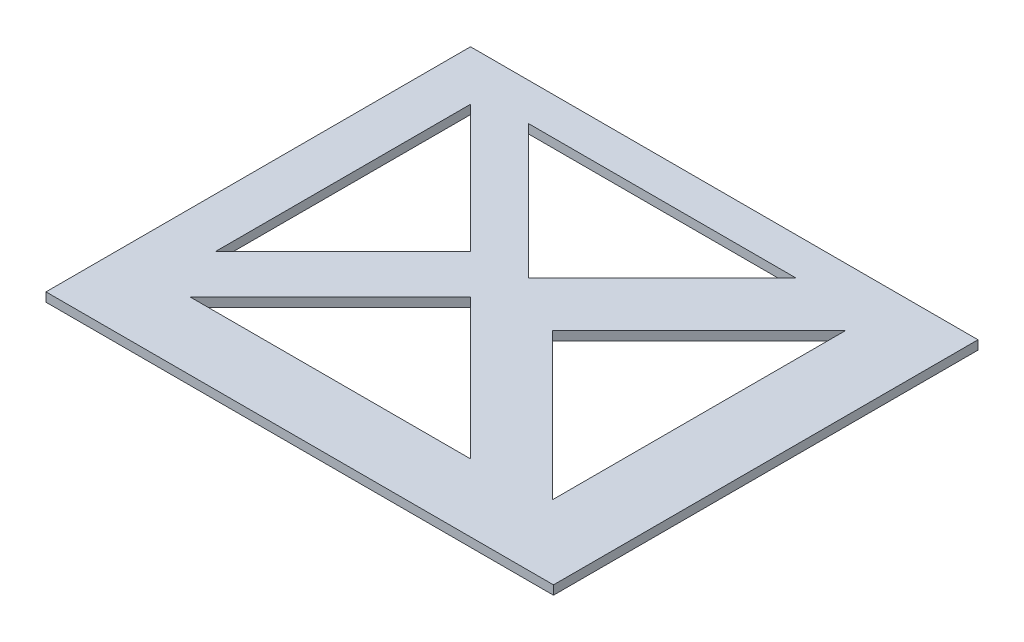
ISO-10303-21;
HEADER;
FILE_DESCRIPTION(('STEP AP214'),'2;1');
FILE_NAME('part.step','',(''),(''),'','','');
FILE_SCHEMA(('AUTOMOTIVE_DESIGN { 1 0 10303 214 1 1 1 1 }'));
ENDSEC;
DATA;
#1=APPLICATION_CONTEXT('core data for automotive mechanical design processes');
#2=APPLICATION_PROTOCOL_DEFINITION('international standard','automotive_design',2000,#1);
#3=PRODUCT_CONTEXT('',#1,'mechanical');
#4=PRODUCT('Part','Part','',(#3));
#5=PRODUCT_RELATED_PRODUCT_CATEGORY('part','',(#4));
#6=PRODUCT_DEFINITION_FORMATION('','',#4);
#7=PRODUCT_DEFINITION_CONTEXT('part definition',#1,'design');
#8=PRODUCT_DEFINITION('design','',#6,#7);
#9=PRODUCT_DEFINITION_SHAPE('','',#8);
#10=(LENGTH_UNIT() NAMED_UNIT(*) SI_UNIT(.MILLI.,.METRE.));
#11=(NAMED_UNIT(*) PLANE_ANGLE_UNIT() SI_UNIT($,.RADIAN.));
#12=(NAMED_UNIT(*) SI_UNIT($,.STERADIAN.) SOLID_ANGLE_UNIT());
#13=UNCERTAINTY_MEASURE_WITH_UNIT(LENGTH_MEASURE(1.E-05),#10,'distance_accuracy_value','');
#14=(GEOMETRIC_REPRESENTATION_CONTEXT(3) GLOBAL_UNCERTAINTY_ASSIGNED_CONTEXT((#13)) GLOBAL_UNIT_ASSIGNED_CONTEXT((#10,
#11,#12)) REPRESENTATION_CONTEXT('',''));
#15=CARTESIAN_POINT('',(0.,0.,0.));
#16=DIRECTION('',(0.,0.,1.));
#17=DIRECTION('',(1.,0.,0.));
#18=AXIS2_PLACEMENT_3D('',#15,#16,#17);
#19=CARTESIAN_POINT('',(0.,0.,0.));
#20=DIRECTION('',(0.,1.,0.));
#21=DIRECTION('',(0.,0.,1.));
#22=AXIS2_PLACEMENT_3D('',#19,#20,#21);
#23=PLANE('',#22);
#24=DIRECTION('',(-0.707106781186547,0.,-0.707106781186548));
#25=VECTOR('',#24,1.);
#26=CARTESIAN_POINT('',(-90.4001985049659,0.,-128.91776936157));
#27=LINE('',#26,#25);
#28=CARTESIAN_POINT('',(-90.4001985049659,0.,-128.91776936157));
#29=VERTEX_POINT('',#28);
#30=CARTESIAN_POINT('',(-105.95654769107,0.,-144.474118547674));
#31=VERTEX_POINT('',#30);
#32=EDGE_CURVE('E193',#29,#31,#27,.T.);
#33=ORIENTED_EDGE('',*,*,#32,.T.);
#34=DIRECTION('',(-0.707106781186547,0.,0.707106781186548));
#35=VECTOR('',#34,1.);
#36=CARTESIAN_POINT('',(-105.95654769107,0.,-144.474118547674));
#37=LINE('',#36,#35);
#38=CARTESIAN_POINT('',(-121.512896877174,0.,-128.91776936157));
#39=VERTEX_POINT('',#38);
#40=EDGE_CURVE('E196',#31,#39,#37,.T.);
#41=ORIENTED_EDGE('',*,*,#40,.T.);
#42=DIRECTION('',(1.,0.,0.));
#43=VECTOR('',#42,1.);
#44=CARTESIAN_POINT('',(-121.512896877174,0.,-128.91776936157));
#45=LINE('',#44,#43);
#46=EDGE_CURVE('E199',#39,#29,#45,.T.);
#47=ORIENTED_EDGE('',*,*,#46,.T.);
#48=EDGE_LOOP('',(#33,#41,#47));
#49=FACE_BOUND('',#48,.T.);
#50=DIRECTION('',(-0.707106781186547,0.,-0.707106781186547));
#51=VECTOR('',#50,1.);
#52=CARTESIAN_POINT('',(-110.367742536169,0.,-148.885313392773));
#53=LINE('',#52,#51);
#54=CARTESIAN_POINT('',(-110.367742536169,0.,-148.885313392773));
#55=VERTEX_POINT('',#54);
#56=CARTESIAN_POINT('',(-124.5098781599,0.,-163.027449016504));
#57=VERTEX_POINT('',#56);
#58=EDGE_CURVE('E223',#55,#57,#53,.T.);
#59=ORIENTED_EDGE('',*,*,#58,.T.);
#60=DIRECTION('',(0.,0.,1.));
#61=VECTOR('',#60,1.);
#62=CARTESIAN_POINT('',(-124.5098781599,0.,-163.027449016504));
#63=LINE('',#62,#61);
#64=CARTESIAN_POINT('',(-124.5098781599,0.,-134.743177769042));
#65=VERTEX_POINT('',#64);
#66=EDGE_CURVE('E226',#57,#65,#63,.T.);
#67=ORIENTED_EDGE('',*,*,#66,.T.);
#68=DIRECTION('',(0.707106781186547,0.,-0.707106781186548));
#69=VECTOR('',#68,1.);
#70=CARTESIAN_POINT('',(-124.5098781599,0.,-134.743177769042));
#71=LINE('',#70,#69);
#72=EDGE_CURVE('E229',#65,#55,#71,.T.);
#73=ORIENTED_EDGE('',*,*,#72,.T.);
#74=EDGE_LOOP('',(#59,#67,#73));
#75=FACE_BOUND('',#74,.T.);
#76=DIRECTION('',(0.,0.,1.));
#77=VECTOR('',#76,1.);
#78=CARTESIAN_POINT('',(-73.6750586068764,0.,-121.406962028885));
#79=LINE('',#78,#77);
#80=CARTESIAN_POINT('',(-73.6750586068764,0.,-168.557732279811));
#81=VERTEX_POINT('',#80);
#82=CARTESIAN_POINT('',(-73.6750586068764,0.,-121.406962028885));
#83=VERTEX_POINT('',#82);
#84=EDGE_CURVE('E246',#81,#83,#79,.T.);
#85=ORIENTED_EDGE('',*,*,#84,.T.);
#86=DIRECTION('',(-1.,0.,0.));
#87=VECTOR('',#86,1.);
#88=CARTESIAN_POINT('',(-130.040161423208,0.,-121.406962028885));
#89=LINE('',#88,#87);
#90=CARTESIAN_POINT('',(-130.040161423208,0.,-121.406962028885));
#91=VERTEX_POINT('',#90);
#92=EDGE_CURVE('E177',#83,#91,#89,.T.);
#93=ORIENTED_EDGE('',*,*,#92,.T.);
#94=DIRECTION('',(0.,0.,1.));
#95=VECTOR('',#94,1.);
#96=CARTESIAN_POINT('',(-130.040161423208,0.,-168.557732279811));
#97=LINE('',#96,#95);
#98=CARTESIAN_POINT('',(-130.040161423208,0.,-168.557732279811));
#99=VERTEX_POINT('',#98);
#100=EDGE_CURVE('E43',#99,#91,#97,.T.);
#101=ORIENTED_EDGE('',*,*,#100,.F.);
#102=DIRECTION('',(-1.,0.,0.));
#103=VECTOR('',#102,1.);
#104=CARTESIAN_POINT('',(-130.040161423208,0.,-168.557732279811));
#105=LINE('',#104,#103);
#106=EDGE_CURVE('E238',#81,#99,#105,.T.);
#107=ORIENTED_EDGE('',*,*,#106,.F.);
#108=EDGE_LOOP('',(#85,#93,#101,#107));
#109=FACE_BOUND('',#108,.T.);
#110=DIRECTION('',(-1.,0.,0.));
#111=VECTOR('',#110,1.);
#112=CARTESIAN_POINT('',(-89.7550085878665,0.,-164.389725441387));
#113=LINE('',#112,#111);
#114=CARTESIAN_POINT('',(-89.7550085878665,0.,-164.389725441387));
#115=VERTEX_POINT('',#114);
#116=CARTESIAN_POINT('',(-119.453493397702,0.,-164.389725441387));
#117=VERTEX_POINT('',#116);
#118=EDGE_CURVE('E208',#115,#117,#113,.T.);
#119=ORIENTED_EDGE('',*,*,#118,.T.);
#120=DIRECTION('',(0.707106781186548,0.,0.707106781186548));
#121=VECTOR('',#120,1.);
#122=CARTESIAN_POINT('',(-119.453493397702,0.,-164.389725441387));
#123=LINE('',#122,#121);
#124=CARTESIAN_POINT('',(-104.604250992784,0.,-149.54048303647));
#125=VERTEX_POINT('',#124);
#126=EDGE_CURVE('E211',#117,#125,#123,.T.);
#127=ORIENTED_EDGE('',*,*,#126,.T.);
#128=DIRECTION('',(0.707106781186547,0.,-0.707106781186547));
#129=VECTOR('',#128,1.);
#130=CARTESIAN_POINT('',(-104.604250992784,0.,-149.54048303647));
#131=LINE('',#130,#129);
#132=EDGE_CURVE('E214',#125,#115,#131,.T.);
#133=ORIENTED_EDGE('',*,*,#132,.T.);
#134=EDGE_LOOP('',(#119,#127,#133));
#135=FACE_BOUND('',#134,.T.);
#136=DIRECTION('',(0.,0.,-1.));
#137=VECTOR('',#136,1.);
#138=CARTESIAN_POINT('',(-81.9149171307273,0.,-162.053694750293));
#139=LINE('',#138,#137);
#140=CARTESIAN_POINT('',(-81.9149171307273,0.,-129.526782815712));
#141=VERTEX_POINT('',#140);
#142=CARTESIAN_POINT('',(-81.9149171307273,0.,-162.053694750293));
#143=VERTEX_POINT('',#142);
#144=EDGE_CURVE('E169',#141,#143,#139,.T.);
#145=ORIENTED_EDGE('',*,*,#144,.T.);
#146=DIRECTION('',(-0.707106781186548,0.,0.707106781186548));
#147=VECTOR('',#146,1.);
#148=CARTESIAN_POINT('',(-81.9149171307273,0.,-162.053694750293));
#149=LINE('',#148,#147);
#150=CARTESIAN_POINT('',(-98.1783730980179,0.,-145.790238783002));
#151=VERTEX_POINT('',#150);
#152=EDGE_CURVE('E172',#143,#151,#149,.T.);
#153=ORIENTED_EDGE('',*,*,#152,.T.);
#154=DIRECTION('',(0.707106781186548,0.,0.707106781186548));
#155=VECTOR('',#154,1.);
#156=CARTESIAN_POINT('',(-98.1783730980179,0.,-145.790238783002));
#157=LINE('',#156,#155);
#158=EDGE_CURVE('E184',#151,#141,#157,.T.);
#159=ORIENTED_EDGE('',*,*,#158,.T.);
#160=EDGE_LOOP('',(#145,#153,#159));
#161=FACE_BOUND('',#160,.T.);
#162=ADVANCED_FACE('F35',(#49,#75,#109,#135,#161),#23,.F.);
#163=CARTESIAN_POINT('',(-130.040161423208,10.,-168.557732279811));
#164=DIRECTION('',(0.,0.,1.));
#165=DIRECTION('',(1.,0.,0.));
#166=AXIS2_PLACEMENT_3D('',#163,#164,#165);
#167=PLANE('',#166);
#168=DIRECTION('',(0.,-1.,0.));
#169=VECTOR('',#168,1.);
#170=CARTESIAN_POINT('',(-130.040161423208,10.,-168.557732279811));
#171=LINE('',#170,#169);
#172=CARTESIAN_POINT('',(-130.040161423208,1.,-168.557732279811));
#173=VERTEX_POINT('',#172);
#174=EDGE_CURVE('E11',#173,#99,#171,.T.);
#175=ORIENTED_EDGE('',*,*,#174,.F.);
#176=DIRECTION('',(-1.,0.,0.));
#177=VECTOR('',#176,1.);
#178=CARTESIAN_POINT('',(-130.040161423208,1.,-168.557732279811));
#179=LINE('',#178,#177);
#180=CARTESIAN_POINT('',(-73.6750586068764,1.,-168.557732279811));
#181=VERTEX_POINT('',#180);
#182=EDGE_CURVE('E152',#181,#173,#179,.T.);
#183=ORIENTED_EDGE('',*,*,#182,.F.);
#184=DIRECTION('',(0.,1.,0.));
#185=VECTOR('',#184,1.);
#186=CARTESIAN_POINT('',(-73.6750586068764,0.,-168.557732279811));
#187=LINE('',#186,#185);
#188=EDGE_CURVE('E174',#81,#181,#187,.T.);
#189=ORIENTED_EDGE('',*,*,#188,.F.);
#190=ORIENTED_EDGE('',*,*,#106,.T.);
#191=EDGE_LOOP('',(#175,#183,#189,#190));
#192=FACE_BOUND('',#191,.T.);
#193=ADVANCED_FACE('F37',(#192),#167,.F.);
#194=CARTESIAN_POINT('',(-130.040161423208,10.,-168.557732279811));
#195=DIRECTION('',(1.,0.,0.));
#196=DIRECTION('',(0.,0.,-1.));
#197=AXIS2_PLACEMENT_3D('',#194,#195,#196);
#198=PLANE('',#197);
#199=DIRECTION('',(0.,1.,0.));
#200=VECTOR('',#199,1.);
#201=CARTESIAN_POINT('',(-130.040161423208,0.,-121.406962028885));
#202=LINE('',#201,#200);
#203=CARTESIAN_POINT('',(-130.040161423208,1.,-121.406962028885));
#204=VERTEX_POINT('',#203);
#205=EDGE_CURVE('E161',#91,#204,#202,.T.);
#206=ORIENTED_EDGE('',*,*,#205,.T.);
#207=DIRECTION('',(0.,0.,1.));
#208=VECTOR('',#207,1.);
#209=CARTESIAN_POINT('',(-130.040161423208,1.,-121.406962028885));
#210=LINE('',#209,#208);
#211=EDGE_CURVE('E146',#173,#204,#210,.T.);
#212=ORIENTED_EDGE('',*,*,#211,.F.);
#213=ORIENTED_EDGE('',*,*,#174,.T.);
#214=ORIENTED_EDGE('',*,*,#100,.T.);
#215=EDGE_LOOP('',(#206,#212,#213,#214));
#216=FACE_BOUND('',#215,.T.);
#217=ADVANCED_FACE('F167',(#216),#198,.F.);
#218=CARTESIAN_POINT('',(-110.367742536169,10.,-148.885313392773));
#219=DIRECTION('',(-0.707106781186548,0.,0.707106781186548));
#220=DIRECTION('',(0.707106781186548,0.,0.707106781186548));
#221=AXIS2_PLACEMENT_3D('',#218,#219,#220);
#222=PLANE('',#221);
#223=DIRECTION('',(0.707106781186548,0.,0.707106781186548));
#224=VECTOR('',#223,1.);
#225=CARTESIAN_POINT('',(-110.367742536169,1.,-148.885313392773));
#226=LINE('',#225,#224);
#227=CARTESIAN_POINT('',(-124.5098781599,1.,-163.027449016504));
#228=VERTEX_POINT('',#227);
#229=CARTESIAN_POINT('',(-110.367742536169,1.,-148.885313392773));
#230=VERTEX_POINT('',#229);
#231=EDGE_CURVE('E50',#228,#230,#226,.T.);
#232=ORIENTED_EDGE('',*,*,#231,.F.);
#233=DIRECTION('',(0.,-1.,0.));
#234=VECTOR('',#233,1.);
#235=CARTESIAN_POINT('',(-124.5098781599,10.,-163.027449016504));
#236=LINE('',#235,#234);
#237=EDGE_CURVE('E236',#228,#57,#236,.T.);
#238=ORIENTED_EDGE('',*,*,#237,.T.);
#239=ORIENTED_EDGE('',*,*,#58,.F.);
#240=DIRECTION('',(0.,-1.,0.));
#241=VECTOR('',#240,1.);
#242=CARTESIAN_POINT('',(-110.367742536169,10.,-148.885313392773));
#243=LINE('',#242,#241);
#244=EDGE_CURVE('E232',#230,#55,#243,.T.);
#245=ORIENTED_EDGE('',*,*,#244,.F.);
#246=EDGE_LOOP('',(#232,#238,#239,#245));
#247=FACE_BOUND('',#246,.T.);
#248=ADVANCED_FACE('F291',(#247),#222,.T.);
#249=CARTESIAN_POINT('',(-124.5098781599,10.,-163.027449016504));
#250=DIRECTION('',(1.,0.,0.));
#251=DIRECTION('',(0.,0.,-1.));
#252=AXIS2_PLACEMENT_3D('',#249,#250,#251);
#253=PLANE('',#252);
#254=DIRECTION('',(0.,0.,-1.));
#255=VECTOR('',#254,1.);
#256=CARTESIAN_POINT('',(-124.5098781599,1.,-163.027449016504));
#257=LINE('',#256,#255);
#258=CARTESIAN_POINT('',(-124.5098781599,1.,-134.743177769042));
#259=VERTEX_POINT('',#258);
#260=EDGE_CURVE('E247',#259,#228,#257,.T.);
#261=ORIENTED_EDGE('',*,*,#260,.F.);
#262=DIRECTION('',(0.,-1.,0.));
#263=VECTOR('',#262,1.);
#264=CARTESIAN_POINT('',(-124.5098781599,10.,-134.743177769042));
#265=LINE('',#264,#263);
#266=EDGE_CURVE('E234',#259,#65,#265,.T.);
#267=ORIENTED_EDGE('',*,*,#266,.T.);
#268=ORIENTED_EDGE('',*,*,#66,.F.);
#269=ORIENTED_EDGE('',*,*,#237,.F.);
#270=EDGE_LOOP('',(#261,#267,#268,#269));
#271=FACE_BOUND('',#270,.T.);
#272=ADVANCED_FACE('F297',(#271),#253,.T.);
#273=CARTESIAN_POINT('',(-124.5098781599,10.,-134.743177769042));
#274=DIRECTION('',(-0.707106781186548,0.,-0.707106781186547));
#275=DIRECTION('',(-0.707106781186547,0.,0.707106781186548));
#276=AXIS2_PLACEMENT_3D('',#273,#274,#275);
#277=PLANE('',#276);
#278=DIRECTION('',(-0.707106781186547,0.,0.707106781186548));
#279=VECTOR('',#278,1.);
#280=CARTESIAN_POINT('',(-124.5098781599,1.,-134.743177769042));
#281=LINE('',#280,#279);
#282=EDGE_CURVE('E251',#230,#259,#281,.T.);
#283=ORIENTED_EDGE('',*,*,#282,.F.);
#284=ORIENTED_EDGE('',*,*,#244,.T.);
#285=ORIENTED_EDGE('',*,*,#72,.F.);
#286=ORIENTED_EDGE('',*,*,#266,.F.);
#287=EDGE_LOOP('',(#283,#284,#285,#286));
#288=FACE_BOUND('',#287,.T.);
#289=ADVANCED_FACE('F302',(#288),#277,.T.);
#290=CARTESIAN_POINT('',(-89.7550085878665,10.,-164.389725441387));
#291=DIRECTION('',(0.,0.,1.));
#292=DIRECTION('',(1.,0.,0.));
#293=AXIS2_PLACEMENT_3D('',#290,#291,#292);
#294=PLANE('',#293);
#295=DIRECTION('',(1.,0.,0.));
#296=VECTOR('',#295,1.);
#297=CARTESIAN_POINT('',(-89.7550085878665,1.,-164.389725441387));
#298=LINE('',#297,#296);
#299=CARTESIAN_POINT('',(-119.453493397702,1.,-164.389725441387));
#300=VERTEX_POINT('',#299);
#301=CARTESIAN_POINT('',(-89.7550085878665,1.,-164.389725441387));
#302=VERTEX_POINT('',#301);
#303=EDGE_CURVE('E58',#300,#302,#298,.T.);
#304=ORIENTED_EDGE('',*,*,#303,.F.);
#305=DIRECTION('',(0.,-1.,0.));
#306=VECTOR('',#305,1.);
#307=CARTESIAN_POINT('',(-119.453493397702,10.,-164.389725441387));
#308=LINE('',#307,#306);
#309=EDGE_CURVE('E221',#300,#117,#308,.T.);
#310=ORIENTED_EDGE('',*,*,#309,.T.);
#311=ORIENTED_EDGE('',*,*,#118,.F.);
#312=DIRECTION('',(0.,-1.,0.));
#313=VECTOR('',#312,1.);
#314=CARTESIAN_POINT('',(-89.7550085878665,10.,-164.389725441387));
#315=LINE('',#314,#313);
#316=EDGE_CURVE('E217',#302,#115,#315,.T.);
#317=ORIENTED_EDGE('',*,*,#316,.F.);
#318=EDGE_LOOP('',(#304,#310,#311,#317));
#319=FACE_BOUND('',#318,.T.);
#320=ADVANCED_FACE('F358',(#319),#294,.T.);
#321=CARTESIAN_POINT('',(-119.453493397702,10.,-164.389725441387));
#322=DIRECTION('',(0.707106781186548,0.,-0.707106781186548));
#323=DIRECTION('',(-0.707106781186548,0.,-0.707106781186548));
#324=AXIS2_PLACEMENT_3D('',#321,#322,#323);
#325=PLANE('',#324);
#326=DIRECTION('',(-0.707106781186548,0.,-0.707106781186548));
#327=VECTOR('',#326,1.);
#328=CARTESIAN_POINT('',(-119.453493397702,1.,-164.389725441387));
#329=LINE('',#328,#327);
#330=CARTESIAN_POINT('',(-104.604250992784,1.,-149.54048303647));
#331=VERTEX_POINT('',#330);
#332=EDGE_CURVE('E254',#331,#300,#329,.T.);
#333=ORIENTED_EDGE('',*,*,#332,.F.);
#334=DIRECTION('',(0.,-1.,0.));
#335=VECTOR('',#334,1.);
#336=CARTESIAN_POINT('',(-104.604250992784,10.,-149.54048303647));
#337=LINE('',#336,#335);
#338=EDGE_CURVE('E219',#331,#125,#337,.T.);
#339=ORIENTED_EDGE('',*,*,#338,.T.);
#340=ORIENTED_EDGE('',*,*,#126,.F.);
#341=ORIENTED_EDGE('',*,*,#309,.F.);
#342=EDGE_LOOP('',(#333,#339,#340,#341));
#343=FACE_BOUND('',#342,.T.);
#344=ADVANCED_FACE('F354',(#343),#325,.T.);
#345=CARTESIAN_POINT('',(-104.604250992784,10.,-149.54048303647));
#346=DIRECTION('',(-0.707106781186548,0.,-0.707106781186548));
#347=DIRECTION('',(-0.707106781186548,0.,0.707106781186548));
#348=AXIS2_PLACEMENT_3D('',#345,#346,#347);
#349=PLANE('',#348);
#350=DIRECTION('',(-0.707106781186548,0.,0.707106781186548));
#351=VECTOR('',#350,1.);
#352=CARTESIAN_POINT('',(-104.604250992784,1.,-149.54048303647));
#353=LINE('',#352,#351);
#354=EDGE_CURVE('E256',#302,#331,#353,.T.);
#355=ORIENTED_EDGE('',*,*,#354,.F.);
#356=ORIENTED_EDGE('',*,*,#316,.T.);
#357=ORIENTED_EDGE('',*,*,#132,.F.);
#358=ORIENTED_EDGE('',*,*,#338,.F.);
#359=EDGE_LOOP('',(#355,#356,#357,#358));
#360=FACE_BOUND('',#359,.T.);
#361=ADVANCED_FACE('F350',(#360),#349,.T.);
#362=CARTESIAN_POINT('',(-90.4001985049659,10.,-128.91776936157));
#363=DIRECTION('',(-0.707106781186548,0.,0.707106781186547));
#364=DIRECTION('',(0.707106781186547,0.,0.707106781186548));
#365=AXIS2_PLACEMENT_3D('',#362,#363,#364);
#366=PLANE('',#365);
#367=DIRECTION('',(0.707106781186547,0.,0.707106781186548));
#368=VECTOR('',#367,1.);
#369=CARTESIAN_POINT('',(-90.4001985049659,1.,-128.91776936157));
#370=LINE('',#369,#368);
#371=CARTESIAN_POINT('',(-105.95654769107,1.,-144.474118547674));
#372=VERTEX_POINT('',#371);
#373=CARTESIAN_POINT('',(-90.4001985049659,1.,-128.91776936157));
#374=VERTEX_POINT('',#373);
#375=EDGE_CURVE('E258',#372,#374,#370,.T.);
#376=ORIENTED_EDGE('',*,*,#375,.F.);
#377=DIRECTION('',(0.,-1.,0.));
#378=VECTOR('',#377,1.);
#379=CARTESIAN_POINT('',(-105.95654769107,10.,-144.474118547674));
#380=LINE('',#379,#378);
#381=EDGE_CURVE('E206',#372,#31,#380,.T.);
#382=ORIENTED_EDGE('',*,*,#381,.T.);
#383=ORIENTED_EDGE('',*,*,#32,.F.);
#384=DIRECTION('',(0.,-1.,0.));
#385=VECTOR('',#384,1.);
#386=CARTESIAN_POINT('',(-90.4001985049659,10.,-128.91776936157));
#387=LINE('',#386,#385);
#388=EDGE_CURVE('E202',#374,#29,#387,.T.);
#389=ORIENTED_EDGE('',*,*,#388,.F.);
#390=EDGE_LOOP('',(#376,#382,#383,#389));
#391=FACE_BOUND('',#390,.T.);
#392=ADVANCED_FACE('F346',(#391),#366,.T.);
#393=CARTESIAN_POINT('',(-105.95654769107,10.,-144.474118547674));
#394=DIRECTION('',(0.707106781186548,0.,0.707106781186547));
#395=DIRECTION('',(0.707106781186547,0.,-0.707106781186548));
#396=AXIS2_PLACEMENT_3D('',#393,#394,#395);
#397=PLANE('',#396);
#398=DIRECTION('',(0.707106781186547,0.,-0.707106781186548));
#399=VECTOR('',#398,1.);
#400=CARTESIAN_POINT('',(-105.95654769107,1.,-144.474118547674));
#401=LINE('',#400,#399);
#402=CARTESIAN_POINT('',(-121.512896877174,1.,-128.91776936157));
#403=VERTEX_POINT('',#402);
#404=EDGE_CURVE('E260',#403,#372,#401,.T.);
#405=ORIENTED_EDGE('',*,*,#404,.F.);
#406=DIRECTION('',(0.,-1.,0.));
#407=VECTOR('',#406,1.);
#408=CARTESIAN_POINT('',(-121.512896877174,10.,-128.91776936157));
#409=LINE('',#408,#407);
#410=EDGE_CURVE('E204',#403,#39,#409,.T.);
#411=ORIENTED_EDGE('',*,*,#410,.T.);
#412=ORIENTED_EDGE('',*,*,#40,.F.);
#413=ORIENTED_EDGE('',*,*,#381,.F.);
#414=EDGE_LOOP('',(#405,#411,#412,#413));
#415=FACE_BOUND('',#414,.T.);
#416=ADVANCED_FACE('F342',(#415),#397,.T.);
#417=CARTESIAN_POINT('',(-121.512896877174,10.,-128.91776936157));
#418=DIRECTION('',(0.,0.,-1.));
#419=DIRECTION('',(-1.,0.,0.));
#420=AXIS2_PLACEMENT_3D('',#417,#418,#419);
#421=PLANE('',#420);
#422=DIRECTION('',(-1.,0.,0.));
#423=VECTOR('',#422,1.);
#424=CARTESIAN_POINT('',(-121.512896877174,1.,-128.91776936157));
#425=LINE('',#424,#423);
#426=EDGE_CURVE('E262',#374,#403,#425,.T.);
#427=ORIENTED_EDGE('',*,*,#426,.F.);
#428=ORIENTED_EDGE('',*,*,#388,.T.);
#429=ORIENTED_EDGE('',*,*,#46,.F.);
#430=ORIENTED_EDGE('',*,*,#410,.F.);
#431=EDGE_LOOP('',(#427,#428,#429,#430));
#432=FACE_BOUND('',#431,.T.);
#433=ADVANCED_FACE('F337',(#432),#421,.T.);
#434=CARTESIAN_POINT('',(-81.9149171307273,10.,-162.053694750293));
#435=DIRECTION('',(-1.,0.,0.));
#436=DIRECTION('',(0.,0.,1.));
#437=AXIS2_PLACEMENT_3D('',#434,#435,#436);
#438=PLANE('',#437);
#439=DIRECTION('',(0.,0.,1.));
#440=VECTOR('',#439,1.);
#441=CARTESIAN_POINT('',(-81.9149171307273,1.,-162.053694750293));
#442=LINE('',#441,#440);
#443=CARTESIAN_POINT('',(-81.9149171307273,1.,-162.053694750293));
#444=VERTEX_POINT('',#443);
#445=CARTESIAN_POINT('',(-81.9149171307273,1.,-129.526782815712));
#446=VERTEX_POINT('',#445);
#447=EDGE_CURVE('E264',#444,#446,#442,.T.);
#448=ORIENTED_EDGE('',*,*,#447,.F.);
#449=DIRECTION('',(0.,-1.,0.));
#450=VECTOR('',#449,1.);
#451=CARTESIAN_POINT('',(-81.9149171307273,10.,-162.053694750293));
#452=LINE('',#451,#450);
#453=EDGE_CURVE('E191',#444,#143,#452,.T.);
#454=ORIENTED_EDGE('',*,*,#453,.T.);
#455=ORIENTED_EDGE('',*,*,#144,.F.);
#456=DIRECTION('',(0.,-1.,0.));
#457=VECTOR('',#456,1.);
#458=CARTESIAN_POINT('',(-81.9149171307273,10.,-129.526782815712));
#459=LINE('',#458,#457);
#460=EDGE_CURVE('E187',#446,#141,#459,.T.);
#461=ORIENTED_EDGE('',*,*,#460,.F.);
#462=EDGE_LOOP('',(#448,#454,#455,#461));
#463=FACE_BOUND('',#462,.T.);
#464=ADVANCED_FACE('F326',(#463),#438,.T.);
#465=CARTESIAN_POINT('',(-81.9149171307273,10.,-162.053694750293));
#466=DIRECTION('',(0.707106781186548,0.,0.707106781186548));
#467=DIRECTION('',(0.707106781186548,0.,-0.707106781186548));
#468=AXIS2_PLACEMENT_3D('',#465,#466,#467);
#469=PLANE('',#468);
#470=DIRECTION('',(0.707106781186548,0.,-0.707106781186548));
#471=VECTOR('',#470,1.);
#472=CARTESIAN_POINT('',(-81.9149171307273,1.,-162.053694750293));
#473=LINE('',#472,#471);
#474=CARTESIAN_POINT('',(-98.1783730980179,1.,-145.790238783002));
#475=VERTEX_POINT('',#474);
#476=EDGE_CURVE('E266',#475,#444,#473,.T.);
#477=ORIENTED_EDGE('',*,*,#476,.F.);
#478=DIRECTION('',(0.,-1.,0.));
#479=VECTOR('',#478,1.);
#480=CARTESIAN_POINT('',(-98.1783730980179,10.,-145.790238783002));
#481=LINE('',#480,#479);
#482=EDGE_CURVE('E189',#475,#151,#481,.T.);
#483=ORIENTED_EDGE('',*,*,#482,.T.);
#484=ORIENTED_EDGE('',*,*,#152,.F.);
#485=ORIENTED_EDGE('',*,*,#453,.F.);
#486=EDGE_LOOP('',(#477,#483,#484,#485));
#487=FACE_BOUND('',#486,.T.);
#488=ADVANCED_FACE('F330',(#487),#469,.T.);
#489=CARTESIAN_POINT('',(-98.1783730980179,10.,-145.790238783002));
#490=DIRECTION('',(0.707106781186548,0.,-0.707106781186548));
#491=DIRECTION('',(-0.707106781186548,0.,-0.707106781186548));
#492=AXIS2_PLACEMENT_3D('',#489,#490,#491);
#493=PLANE('',#492);
#494=DIRECTION('',(-0.707106781186548,0.,-0.707106781186548));
#495=VECTOR('',#494,1.);
#496=CARTESIAN_POINT('',(-98.1783730980179,1.,-145.790238783002));
#497=LINE('',#496,#495);
#498=EDGE_CURVE('E268',#446,#475,#497,.T.);
#499=ORIENTED_EDGE('',*,*,#498,.F.);
#500=ORIENTED_EDGE('',*,*,#460,.T.);
#501=ORIENTED_EDGE('',*,*,#158,.F.);
#502=ORIENTED_EDGE('',*,*,#482,.F.);
#503=EDGE_LOOP('',(#499,#500,#501,#502));
#504=FACE_BOUND('',#503,.T.);
#505=ADVANCED_FACE('F280',(#504),#493,.T.);
#506=CARTESIAN_POINT('',(-130.040161423208,0.,-121.406962028885));
#507=DIRECTION('',(0.,0.,-1.));
#508=DIRECTION('',(-1.,0.,0.));
#509=AXIS2_PLACEMENT_3D('',#506,#507,#508);
#510=PLANE('',#509);
#511=DIRECTION('',(0.,1.,0.));
#512=VECTOR('',#511,1.);
#513=CARTESIAN_POINT('',(-73.6750586068764,0.,-121.406962028885));
#514=LINE('',#513,#512);
#515=CARTESIAN_POINT('',(-73.6750586068764,1.,-121.406962028885));
#516=VERTEX_POINT('',#515);
#517=EDGE_CURVE('E163',#83,#516,#514,.T.);
#518=ORIENTED_EDGE('',*,*,#517,.T.);
#519=DIRECTION('',(1.,0.,0.));
#520=VECTOR('',#519,1.);
#521=CARTESIAN_POINT('',(-73.6750586068764,1.,-121.406962028885));
#522=LINE('',#521,#520);
#523=EDGE_CURVE('E149',#204,#516,#522,.T.);
#524=ORIENTED_EDGE('',*,*,#523,.F.);
#525=ORIENTED_EDGE('',*,*,#205,.F.);
#526=ORIENTED_EDGE('',*,*,#92,.F.);
#527=EDGE_LOOP('',(#518,#524,#525,#526));
#528=FACE_BOUND('',#527,.T.);
#529=ADVANCED_FACE('F159',(#528),#510,.F.);
#530=CARTESIAN_POINT('',(-73.6750586068764,0.,-121.406962028885));
#531=DIRECTION('',(-1.,0.,0.));
#532=DIRECTION('',(0.,0.,1.));
#533=AXIS2_PLACEMENT_3D('',#530,#531,#532);
#534=PLANE('',#533);
#535=ORIENTED_EDGE('',*,*,#188,.T.);
#536=DIRECTION('',(0.,0.,-1.));
#537=VECTOR('',#536,1.);
#538=CARTESIAN_POINT('',(-73.6750586068764,1.,-168.557732279811));
#539=LINE('',#538,#537);
#540=EDGE_CURVE('E164',#516,#181,#539,.T.);
#541=ORIENTED_EDGE('',*,*,#540,.F.);
#542=ORIENTED_EDGE('',*,*,#517,.F.);
#543=ORIENTED_EDGE('',*,*,#84,.F.);
#544=EDGE_LOOP('',(#535,#541,#542,#543));
#545=FACE_BOUND('',#544,.T.);
#546=ADVANCED_FACE('F272',(#545),#534,.F.);
#547=CARTESIAN_POINT('',(0.,1.,0.));
#548=DIRECTION('',(0.,-1.,0.));
#549=DIRECTION('',(0.,0.,-1.));
#550=AXIS2_PLACEMENT_3D('',#547,#548,#549);
#551=PLANE('',#550);
#552=ORIENTED_EDGE('',*,*,#231,.T.);
#553=ORIENTED_EDGE('',*,*,#282,.T.);
#554=ORIENTED_EDGE('',*,*,#260,.T.);
#555=EDGE_LOOP('',(#552,#553,#554));
#556=FACE_BOUND('',#555,.T.);
#557=ORIENTED_EDGE('',*,*,#303,.T.);
#558=ORIENTED_EDGE('',*,*,#354,.T.);
#559=ORIENTED_EDGE('',*,*,#332,.T.);
#560=EDGE_LOOP('',(#557,#558,#559));
#561=FACE_BOUND('',#560,.T.);
#562=ORIENTED_EDGE('',*,*,#375,.T.);
#563=ORIENTED_EDGE('',*,*,#426,.T.);
#564=ORIENTED_EDGE('',*,*,#404,.T.);
#565=EDGE_LOOP('',(#562,#563,#564));
#566=FACE_BOUND('',#565,.T.);
#567=ORIENTED_EDGE('',*,*,#447,.T.);
#568=ORIENTED_EDGE('',*,*,#498,.T.);
#569=ORIENTED_EDGE('',*,*,#476,.T.);
#570=EDGE_LOOP('',(#567,#568,#569));
#571=FACE_BOUND('',#570,.T.);
#572=ORIENTED_EDGE('',*,*,#211,.T.);
#573=ORIENTED_EDGE('',*,*,#523,.T.);
#574=ORIENTED_EDGE('',*,*,#540,.T.);
#575=ORIENTED_EDGE('',*,*,#182,.T.);
#576=EDGE_LOOP('',(#572,#573,#574,#575));
#577=FACE_BOUND('',#576,.T.);
#578=ADVANCED_FACE('F148',(#556,#561,#566,#571,#577),#551,.F.);
#579=CLOSED_SHELL('',(#162,#193,#217,#248,#272,#289,#320,#344,#361,#392,#416,#433,#464,#488,
#505,#529,#546,#578));
#580=MANIFOLD_SOLID_BREP('B2',#579);
#581=ADVANCED_BREP_SHAPE_REPRESENTATION('',(#18,#580),#14);
#582=SHAPE_DEFINITION_REPRESENTATION(#9,#581);
ENDSEC;
END-ISO-10303-21;
